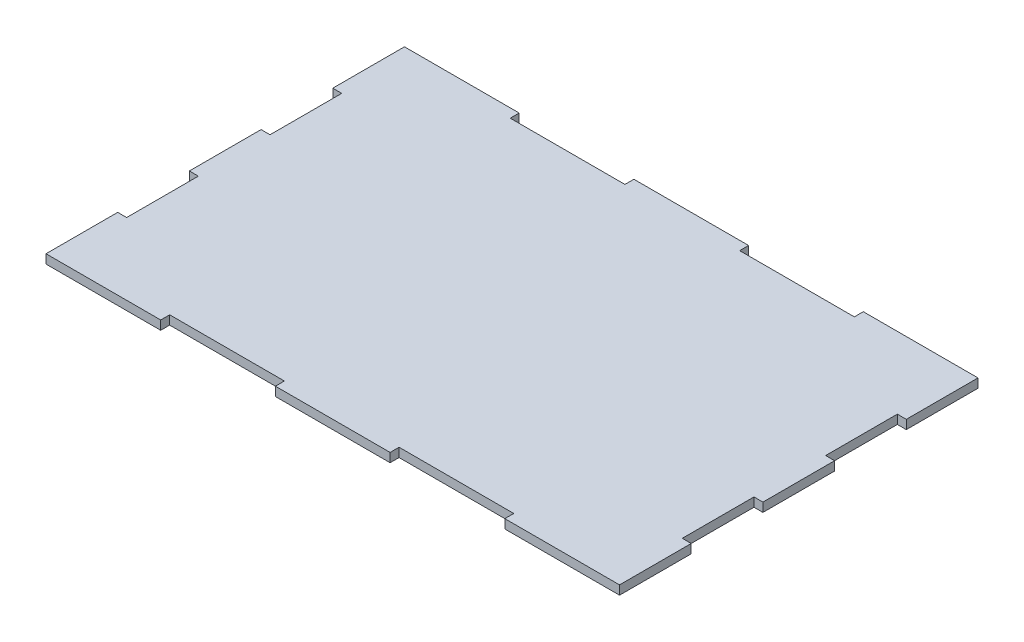
ISO-10303-21;
HEADER;
FILE_DESCRIPTION(('STEP AP214'),'2;1');
FILE_NAME('part.step','',(''),(''),'','','');
FILE_SCHEMA(('AUTOMOTIVE_DESIGN { 1 0 10303 214 1 1 1 1 }'));
ENDSEC;
DATA;
#1=APPLICATION_CONTEXT('core data for automotive mechanical design processes');
#2=APPLICATION_PROTOCOL_DEFINITION('international standard','automotive_design',2000,#1);
#3=PRODUCT_CONTEXT('',#1,'mechanical');
#4=PRODUCT('Part','Part','',(#3));
#5=PRODUCT_RELATED_PRODUCT_CATEGORY('part','',(#4));
#6=PRODUCT_DEFINITION_FORMATION('','',#4);
#7=PRODUCT_DEFINITION_CONTEXT('part definition',#1,'design');
#8=PRODUCT_DEFINITION('design','',#6,#7);
#9=PRODUCT_DEFINITION_SHAPE('','',#8);
#10=(LENGTH_UNIT() NAMED_UNIT(*) SI_UNIT(.MILLI.,.METRE.));
#11=(NAMED_UNIT(*) PLANE_ANGLE_UNIT() SI_UNIT($,.RADIAN.));
#12=(NAMED_UNIT(*) SI_UNIT($,.STERADIAN.) SOLID_ANGLE_UNIT());
#13=UNCERTAINTY_MEASURE_WITH_UNIT(LENGTH_MEASURE(1.E-05),#10,'distance_accuracy_value','');
#14=(GEOMETRIC_REPRESENTATION_CONTEXT(3) GLOBAL_UNCERTAINTY_ASSIGNED_CONTEXT((#13)) GLOBAL_UNIT_ASSIGNED_CONTEXT((#10,
#11,#12)) REPRESENTATION_CONTEXT('',''));
#15=CARTESIAN_POINT('',(0.,0.,0.));
#16=DIRECTION('',(0.,0.,1.));
#17=DIRECTION('',(1.,0.,0.));
#18=AXIS2_PLACEMENT_3D('',#15,#16,#17);
#19=CARTESIAN_POINT('',(101.6,3.175,63.5));
#20=DIRECTION('',(-1.,0.,0.));
#21=DIRECTION('',(0.,0.,1.));
#22=AXIS2_PLACEMENT_3D('',#19,#20,#21);
#23=PLANE('',#22);
#24=DIRECTION('',(0.,0.,-1.));
#25=VECTOR('',#24,1.);
#26=CARTESIAN_POINT('',(101.6,0.,63.5));
#27=LINE('',#26,#25);
#28=CARTESIAN_POINT('',(101.6,0.,12.7));
#29=VERTEX_POINT('',#28);
#30=CARTESIAN_POINT('',(101.6,0.,-12.7));
#31=VERTEX_POINT('',#30);
#32=EDGE_CURVE('E289',#29,#31,#27,.T.);
#33=ORIENTED_EDGE('',*,*,#32,.T.);
#34=DIRECTION('',(0.,1.,0.));
#35=VECTOR('',#34,1.);
#36=CARTESIAN_POINT('',(101.6,0.,-12.7));
#37=LINE('',#36,#35);
#38=CARTESIAN_POINT('',(101.6,3.175,-12.7));
#39=VERTEX_POINT('',#38);
#40=EDGE_CURVE('E940',#31,#39,#37,.T.);
#41=ORIENTED_EDGE('',*,*,#40,.T.);
#42=DIRECTION('',(0.,0.,-1.));
#43=VECTOR('',#42,1.);
#44=CARTESIAN_POINT('',(101.6,3.175,63.5));
#45=LINE('',#44,#43);
#46=CARTESIAN_POINT('',(101.6,3.175,12.7));
#47=VERTEX_POINT('',#46);
#48=EDGE_CURVE('E339',#47,#39,#45,.T.);
#49=ORIENTED_EDGE('',*,*,#48,.F.);
#50=DIRECTION('',(0.,1.,0.));
#51=VECTOR('',#50,1.);
#52=CARTESIAN_POINT('',(101.6,0.,12.7));
#53=LINE('',#52,#51);
#54=EDGE_CURVE('E573',#29,#47,#53,.T.);
#55=ORIENTED_EDGE('',*,*,#54,.F.);
#56=EDGE_LOOP('',(#33,#41,#49,#55));
#57=FACE_BOUND('',#56,.T.);
#58=ADVANCED_FACE('F33',(#57),#23,.F.);
#59=CARTESIAN_POINT('',(101.6,0.,63.5));
#60=VERTEX_POINT('',#59);
#61=CARTESIAN_POINT('',(101.6,0.,38.1));
#62=VERTEX_POINT('',#61);
#63=EDGE_CURVE('E292',#60,#62,#27,.T.);
#64=ORIENTED_EDGE('',*,*,#63,.T.);
#65=DIRECTION('',(0.,1.,0.));
#66=VECTOR('',#65,1.);
#67=CARTESIAN_POINT('',(101.6,0.,38.1));
#68=LINE('',#67,#66);
#69=CARTESIAN_POINT('',(101.6,3.175,38.1));
#70=VERTEX_POINT('',#69);
#71=EDGE_CURVE('E399',#62,#70,#68,.T.);
#72=ORIENTED_EDGE('',*,*,#71,.T.);
#73=CARTESIAN_POINT('',(101.6,3.175,63.5));
#74=VERTEX_POINT('',#73);
#75=EDGE_CURVE('E341',#74,#70,#45,.T.);
#76=ORIENTED_EDGE('',*,*,#75,.F.);
#77=DIRECTION('',(0.,-1.,0.));
#78=VECTOR('',#77,1.);
#79=CARTESIAN_POINT('',(101.6,3.175,63.5));
#80=LINE('',#79,#78);
#81=EDGE_CURVE('E373',#74,#60,#80,.T.);
#82=ORIENTED_EDGE('',*,*,#81,.T.);
#83=EDGE_LOOP('',(#64,#72,#76,#82));
#84=FACE_BOUND('',#83,.T.);
#85=ADVANCED_FACE('F560',(#84),#23,.F.);
#86=CARTESIAN_POINT('',(-101.6,3.175,63.5));
#87=DIRECTION('',(1.,0.,0.));
#88=DIRECTION('',(0.,0.,-1.));
#89=AXIS2_PLACEMENT_3D('',#86,#87,#88);
#90=PLANE('',#89);
#91=DIRECTION('',(0.,0.,1.));
#92=VECTOR('',#91,1.);
#93=CARTESIAN_POINT('',(-101.6,0.,63.5));
#94=LINE('',#93,#92);
#95=CARTESIAN_POINT('',(-101.6,0.,-63.5));
#96=VERTEX_POINT('',#95);
#97=CARTESIAN_POINT('',(-101.6,0.,-38.1));
#98=VERTEX_POINT('',#97);
#99=EDGE_CURVE('E315',#96,#98,#94,.T.);
#100=ORIENTED_EDGE('',*,*,#99,.T.);
#101=DIRECTION('',(0.,1.,0.));
#102=VECTOR('',#101,1.);
#103=CARTESIAN_POINT('',(-101.6,0.,-38.1));
#104=LINE('',#103,#102);
#105=CARTESIAN_POINT('',(-101.6,3.175,-38.1));
#106=VERTEX_POINT('',#105);
#107=EDGE_CURVE('E404',#98,#106,#104,.T.);
#108=ORIENTED_EDGE('',*,*,#107,.T.);
#109=DIRECTION('',(0.,0.,1.));
#110=VECTOR('',#109,1.);
#111=CARTESIAN_POINT('',(-101.6,3.175,63.5));
#112=LINE('',#111,#110);
#113=CARTESIAN_POINT('',(-101.6,3.175,-63.5));
#114=VERTEX_POINT('',#113);
#115=EDGE_CURVE('E361',#114,#106,#112,.T.);
#116=ORIENTED_EDGE('',*,*,#115,.F.);
#117=DIRECTION('',(0.,-1.,0.));
#118=VECTOR('',#117,1.);
#119=CARTESIAN_POINT('',(-101.6,3.175,-63.5));
#120=LINE('',#119,#118);
#121=EDGE_CURVE('E41',#114,#96,#120,.T.);
#122=ORIENTED_EDGE('',*,*,#121,.T.);
#123=EDGE_LOOP('',(#100,#108,#116,#122));
#124=FACE_BOUND('',#123,.T.);
#125=ADVANCED_FACE('F378',(#124),#90,.F.);
#126=CARTESIAN_POINT('',(-101.6,3.175,-12.7));
#127=VERTEX_POINT('',#126);
#128=CARTESIAN_POINT('',(-101.6,3.175,12.7));
#129=VERTEX_POINT('',#128);
#130=EDGE_CURVE('E360',#127,#129,#112,.T.);
#131=ORIENTED_EDGE('',*,*,#130,.F.);
#132=DIRECTION('',(0.,1.,0.));
#133=VECTOR('',#132,1.);
#134=CARTESIAN_POINT('',(-101.6,0.,-12.7));
#135=LINE('',#134,#133);
#136=CARTESIAN_POINT('',(-101.6,0.,-12.7));
#137=VERTEX_POINT('',#136);
#138=EDGE_CURVE('E387',#137,#127,#135,.T.);
#139=ORIENTED_EDGE('',*,*,#138,.F.);
#140=CARTESIAN_POINT('',(-101.6,0.,12.7));
#141=VERTEX_POINT('',#140);
#142=EDGE_CURVE('E314',#137,#141,#94,.T.);
#143=ORIENTED_EDGE('',*,*,#142,.T.);
#144=DIRECTION('',(0.,1.,0.));
#145=VECTOR('',#144,1.);
#146=CARTESIAN_POINT('',(-101.6,0.,12.7));
#147=LINE('',#146,#145);
#148=EDGE_CURVE('E428',#141,#129,#147,.T.);
#149=ORIENTED_EDGE('',*,*,#148,.T.);
#150=EDGE_LOOP('',(#131,#139,#143,#149));
#151=FACE_BOUND('',#150,.T.);
#152=ADVANCED_FACE('F583',(#151),#90,.F.);
#153=CARTESIAN_POINT('',(-101.6,3.175,-63.5));
#154=DIRECTION('',(0.,0.,1.));
#155=DIRECTION('',(1.,0.,0.));
#156=AXIS2_PLACEMENT_3D('',#153,#154,#155);
#157=PLANE('',#156);
#158=DIRECTION('',(-1.,0.,0.));
#159=VECTOR('',#158,1.);
#160=CARTESIAN_POINT('',(-101.6,0.,-63.5));
#161=LINE('',#160,#159);
#162=CARTESIAN_POINT('',(101.6,0.,-63.5));
#163=VERTEX_POINT('',#162);
#164=CARTESIAN_POINT('',(60.96,0.,-63.5));
#165=VERTEX_POINT('',#164);
#166=EDGE_CURVE('E288',#163,#165,#161,.T.);
#167=ORIENTED_EDGE('',*,*,#166,.T.);
#168=DIRECTION('',(0.,1.,0.));
#169=VECTOR('',#168,1.);
#170=CARTESIAN_POINT('',(60.96,0.,-63.5));
#171=LINE('',#170,#169);
#172=CARTESIAN_POINT('',(60.96,3.175,-63.5));
#173=VERTEX_POINT('',#172);
#174=EDGE_CURVE('E446',#165,#173,#171,.T.);
#175=ORIENTED_EDGE('',*,*,#174,.T.);
#176=DIRECTION('',(-1.,0.,0.));
#177=VECTOR('',#176,1.);
#178=CARTESIAN_POINT('',(-101.6,3.175,-63.5));
#179=LINE('',#178,#177);
#180=CARTESIAN_POINT('',(101.6,3.175,-63.5));
#181=VERTEX_POINT('',#180);
#182=EDGE_CURVE('E353',#181,#173,#179,.T.);
#183=ORIENTED_EDGE('',*,*,#182,.F.);
#184=DIRECTION('',(0.,-1.,0.));
#185=VECTOR('',#184,1.);
#186=CARTESIAN_POINT('',(101.6,3.175,-63.5));
#187=LINE('',#186,#185);
#188=EDGE_CURVE('E11',#181,#163,#187,.T.);
#189=ORIENTED_EDGE('',*,*,#188,.T.);
#190=EDGE_LOOP('',(#167,#175,#183,#189));
#191=FACE_BOUND('',#190,.T.);
#192=ADVANCED_FACE('F619',(#191),#157,.F.);
#193=CARTESIAN_POINT('',(20.32,3.175,-63.5));
#194=VERTEX_POINT('',#193);
#195=CARTESIAN_POINT('',(-20.32,3.175,-63.5));
#196=VERTEX_POINT('',#195);
#197=EDGE_CURVE('E352',#194,#196,#179,.T.);
#198=ORIENTED_EDGE('',*,*,#197,.F.);
#199=DIRECTION('',(0.,1.,0.));
#200=VECTOR('',#199,1.);
#201=CARTESIAN_POINT('',(20.32,0.,-63.5));
#202=LINE('',#201,#200);
#203=CARTESIAN_POINT('',(20.32,0.,-63.5));
#204=VERTEX_POINT('',#203);
#205=EDGE_CURVE('E458',#204,#194,#202,.T.);
#206=ORIENTED_EDGE('',*,*,#205,.F.);
#207=CARTESIAN_POINT('',(-20.32,0.,-63.5));
#208=VERTEX_POINT('',#207);
#209=EDGE_CURVE('E304',#204,#208,#161,.T.);
#210=ORIENTED_EDGE('',*,*,#209,.T.);
#211=DIRECTION('',(0.,1.,0.));
#212=VECTOR('',#211,1.);
#213=CARTESIAN_POINT('',(-20.32,0.,-63.5));
#214=LINE('',#213,#212);
#215=EDGE_CURVE('E470',#208,#196,#214,.T.);
#216=ORIENTED_EDGE('',*,*,#215,.T.);
#217=EDGE_LOOP('',(#198,#206,#210,#216));
#218=FACE_BOUND('',#217,.T.);
#219=ADVANCED_FACE('F620',(#218),#157,.F.);
#220=CARTESIAN_POINT('',(-101.6,3.175,63.5));
#221=DIRECTION('',(0.,0.,-1.));
#222=DIRECTION('',(-1.,0.,0.));
#223=AXIS2_PLACEMENT_3D('',#220,#221,#222);
#224=PLANE('',#223);
#225=DIRECTION('',(1.,0.,0.));
#226=VECTOR('',#225,1.);
#227=CARTESIAN_POINT('',(-101.6,3.175,63.5));
#228=LINE('',#227,#226);
#229=CARTESIAN_POINT('',(60.96,3.175,63.5));
#230=VERTEX_POINT('',#229);
#231=EDGE_CURVE('E365',#230,#74,#228,.T.);
#232=ORIENTED_EDGE('',*,*,#231,.F.);
#233=DIRECTION('',(0.,1.,0.));
#234=VECTOR('',#233,1.);
#235=CARTESIAN_POINT('',(60.96,0.,63.5));
#236=LINE('',#235,#234);
#237=CARTESIAN_POINT('',(60.96,0.,63.5));
#238=VERTEX_POINT('',#237);
#239=EDGE_CURVE('E504',#238,#230,#236,.T.);
#240=ORIENTED_EDGE('',*,*,#239,.F.);
#241=DIRECTION('',(1.,0.,0.));
#242=VECTOR('',#241,1.);
#243=CARTESIAN_POINT('',(-101.6,0.,63.5));
#244=LINE('',#243,#242);
#245=EDGE_CURVE('E323',#238,#60,#244,.T.);
#246=ORIENTED_EDGE('',*,*,#245,.T.);
#247=ORIENTED_EDGE('',*,*,#81,.F.);
#248=EDGE_LOOP('',(#232,#240,#246,#247));
#249=FACE_BOUND('',#248,.T.);
#250=ADVANCED_FACE('F559',(#249),#224,.F.);
#251=CARTESIAN_POINT('',(-20.32,0.,63.5));
#252=VERTEX_POINT('',#251);
#253=CARTESIAN_POINT('',(20.32,0.,63.5));
#254=VERTEX_POINT('',#253);
#255=EDGE_CURVE('E327',#252,#254,#244,.T.);
#256=ORIENTED_EDGE('',*,*,#255,.T.);
#257=DIRECTION('',(0.,1.,0.));
#258=VECTOR('',#257,1.);
#259=CARTESIAN_POINT('',(20.32,0.,63.5));
#260=LINE('',#259,#258);
#261=CARTESIAN_POINT('',(20.32,3.175,63.5));
#262=VERTEX_POINT('',#261);
#263=EDGE_CURVE('E507',#254,#262,#260,.T.);
#264=ORIENTED_EDGE('',*,*,#263,.T.);
#265=CARTESIAN_POINT('',(-20.32,3.175,63.5));
#266=VERTEX_POINT('',#265);
#267=EDGE_CURVE('E368',#266,#262,#228,.T.);
#268=ORIENTED_EDGE('',*,*,#267,.F.);
#269=DIRECTION('',(0.,1.,0.));
#270=VECTOR('',#269,1.);
#271=CARTESIAN_POINT('',(-20.32,0.,63.5));
#272=LINE('',#271,#270);
#273=EDGE_CURVE('E290',#252,#266,#272,.T.);
#274=ORIENTED_EDGE('',*,*,#273,.F.);
#275=EDGE_LOOP('',(#256,#264,#268,#274));
#276=FACE_BOUND('',#275,.T.);
#277=ADVANCED_FACE('F548',(#276),#224,.F.);
#278=CARTESIAN_POINT('',(101.6,3.175,-38.1));
#279=VERTEX_POINT('',#278);
#280=EDGE_CURVE('E281',#279,#181,#45,.T.);
#281=ORIENTED_EDGE('',*,*,#280,.F.);
#282=DIRECTION('',(0.,1.,0.));
#283=VECTOR('',#282,1.);
#284=CARTESIAN_POINT('',(101.6,0.,-38.1));
#285=LINE('',#284,#283);
#286=CARTESIAN_POINT('',(101.6,0.,-38.1));
#287=VERTEX_POINT('',#286);
#288=EDGE_CURVE('E269',#287,#279,#285,.T.);
#289=ORIENTED_EDGE('',*,*,#288,.F.);
#290=EDGE_CURVE('E279',#287,#163,#27,.T.);
#291=ORIENTED_EDGE('',*,*,#290,.T.);
#292=ORIENTED_EDGE('',*,*,#188,.F.);
#293=EDGE_LOOP('',(#281,#289,#291,#292));
#294=FACE_BOUND('',#293,.T.);
#295=ADVANCED_FACE('F35',(#294),#23,.F.);
#296=CARTESIAN_POINT('',(-60.96,3.175,-63.5));
#297=VERTEX_POINT('',#296);
#298=EDGE_CURVE('E349',#297,#114,#179,.T.);
#299=ORIENTED_EDGE('',*,*,#298,.F.);
#300=DIRECTION('',(0.,1.,0.));
#301=VECTOR('',#300,1.);
#302=CARTESIAN_POINT('',(-60.96,0.,-63.5));
#303=LINE('',#302,#301);
#304=CARTESIAN_POINT('',(-60.96,0.,-63.5));
#305=VERTEX_POINT('',#304);
#306=EDGE_CURVE('E483',#305,#297,#303,.T.);
#307=ORIENTED_EDGE('',*,*,#306,.F.);
#308=EDGE_CURVE('E299',#305,#96,#161,.T.);
#309=ORIENTED_EDGE('',*,*,#308,.T.);
#310=ORIENTED_EDGE('',*,*,#121,.F.);
#311=EDGE_LOOP('',(#299,#307,#309,#310));
#312=FACE_BOUND('',#311,.T.);
#313=ADVANCED_FACE('F614',(#312),#157,.F.);
#314=CARTESIAN_POINT('',(-101.6,3.175,38.1));
#315=VERTEX_POINT('',#314);
#316=CARTESIAN_POINT('',(-101.6,3.175,63.5));
#317=VERTEX_POINT('',#316);
#318=EDGE_CURVE('E358',#315,#317,#112,.T.);
#319=ORIENTED_EDGE('',*,*,#318,.F.);
#320=DIRECTION('',(0.,1.,0.));
#321=VECTOR('',#320,1.);
#322=CARTESIAN_POINT('',(-101.6,0.,38.1));
#323=LINE('',#322,#321);
#324=CARTESIAN_POINT('',(-101.6,0.,38.1));
#325=VERTEX_POINT('',#324);
#326=EDGE_CURVE('E420',#325,#315,#323,.T.);
#327=ORIENTED_EDGE('',*,*,#326,.F.);
#328=CARTESIAN_POINT('',(-101.6,0.,63.5));
#329=VERTEX_POINT('',#328);
#330=EDGE_CURVE('E311',#325,#329,#94,.T.);
#331=ORIENTED_EDGE('',*,*,#330,.T.);
#332=DIRECTION('',(0.,-1.,0.));
#333=VECTOR('',#332,1.);
#334=CARTESIAN_POINT('',(-101.6,3.175,63.5));
#335=LINE('',#334,#333);
#336=EDGE_CURVE('E376',#317,#329,#335,.T.);
#337=ORIENTED_EDGE('',*,*,#336,.F.);
#338=EDGE_LOOP('',(#319,#327,#331,#337));
#339=FACE_BOUND('',#338,.T.);
#340=ADVANCED_FACE('F595',(#339),#90,.F.);
#341=CARTESIAN_POINT('',(-60.96,0.,63.5));
#342=VERTEX_POINT('',#341);
#343=EDGE_CURVE('E328',#329,#342,#244,.T.);
#344=ORIENTED_EDGE('',*,*,#343,.T.);
#345=DIRECTION('',(0.,1.,0.));
#346=VECTOR('',#345,1.);
#347=CARTESIAN_POINT('',(-60.96,0.,63.5));
#348=LINE('',#347,#346);
#349=CARTESIAN_POINT('',(-60.96,3.175,63.5));
#350=VERTEX_POINT('',#349);
#351=EDGE_CURVE('E294',#342,#350,#348,.T.);
#352=ORIENTED_EDGE('',*,*,#351,.T.);
#353=EDGE_CURVE('E369',#317,#350,#228,.T.);
#354=ORIENTED_EDGE('',*,*,#353,.F.);
#355=ORIENTED_EDGE('',*,*,#336,.T.);
#356=EDGE_LOOP('',(#344,#352,#354,#355));
#357=FACE_BOUND('',#356,.T.);
#358=ADVANCED_FACE('F545',(#357),#224,.F.);
#359=CARTESIAN_POINT('',(0.,3.175,0.));
#360=DIRECTION('',(0.,-1.,0.));
#361=DIRECTION('',(0.,0.,-1.));
#362=AXIS2_PLACEMENT_3D('',#359,#360,#361);
#363=PLANE('',#362);
#364=ORIENTED_EDGE('',*,*,#48,.T.);
#365=DIRECTION('',(1.,0.,0.));
#366=VECTOR('',#365,1.);
#367=CARTESIAN_POINT('',(101.6,3.175,-12.7));
#368=LINE('',#367,#366);
#369=CARTESIAN_POINT('',(98.425,3.175,-12.7));
#370=VERTEX_POINT('',#369);
#371=EDGE_CURVE('E274',#370,#39,#368,.T.);
#372=ORIENTED_EDGE('',*,*,#371,.F.);
#373=DIRECTION('',(0.,0.,1.));
#374=VECTOR('',#373,1.);
#375=CARTESIAN_POINT('',(98.425,3.175,-12.7));
#376=LINE('',#375,#374);
#377=CARTESIAN_POINT('',(98.425,3.175,-38.1));
#378=VERTEX_POINT('',#377);
#379=EDGE_CURVE('E928',#378,#370,#376,.T.);
#380=ORIENTED_EDGE('',*,*,#379,.F.);
#381=DIRECTION('',(-1.,0.,0.));
#382=VECTOR('',#381,1.);
#383=CARTESIAN_POINT('',(101.6,3.175,-38.1));
#384=LINE('',#383,#382);
#385=EDGE_CURVE('E932',#279,#378,#384,.T.);
#386=ORIENTED_EDGE('',*,*,#385,.F.);
#387=ORIENTED_EDGE('',*,*,#280,.T.);
#388=ORIENTED_EDGE('',*,*,#182,.T.);
#389=DIRECTION('',(0.,0.,-1.));
#390=VECTOR('',#389,1.);
#391=CARTESIAN_POINT('',(60.96,3.175,-60.325));
#392=LINE('',#391,#390);
#393=CARTESIAN_POINT('',(60.96,3.175,-60.325));
#394=VERTEX_POINT('',#393);
#395=EDGE_CURVE('E431',#394,#173,#392,.T.);
#396=ORIENTED_EDGE('',*,*,#395,.F.);
#397=DIRECTION('',(1.,0.,0.));
#398=VECTOR('',#397,1.);
#399=CARTESIAN_POINT('',(60.96,3.175,-60.325));
#400=LINE('',#399,#398);
#401=CARTESIAN_POINT('',(20.32,3.175,-60.325));
#402=VERTEX_POINT('',#401);
#403=EDGE_CURVE('E440',#402,#394,#400,.T.);
#404=ORIENTED_EDGE('',*,*,#403,.F.);
#405=DIRECTION('',(0.,0.,1.));
#406=VECTOR('',#405,1.);
#407=CARTESIAN_POINT('',(20.32,3.175,-60.325));
#408=LINE('',#407,#406);
#409=EDGE_CURVE('E448',#194,#402,#408,.T.);
#410=ORIENTED_EDGE('',*,*,#409,.F.);
#411=ORIENTED_EDGE('',*,*,#197,.T.);
#412=DIRECTION('',(0.,0.,-1.));
#413=VECTOR('',#412,1.);
#414=CARTESIAN_POINT('',(-20.32,3.175,-60.325));
#415=LINE('',#414,#413);
#416=CARTESIAN_POINT('',(-20.32,3.175,-60.325));
#417=VERTEX_POINT('',#416);
#418=EDGE_CURVE('E455',#417,#196,#415,.T.);
#419=ORIENTED_EDGE('',*,*,#418,.F.);
#420=DIRECTION('',(1.,0.,0.));
#421=VECTOR('',#420,1.);
#422=CARTESIAN_POINT('',(-20.32,3.175,-60.325));
#423=LINE('',#422,#421);
#424=CARTESIAN_POINT('',(-60.96,3.175,-60.325));
#425=VERTEX_POINT('',#424);
#426=EDGE_CURVE('E465',#425,#417,#423,.T.);
#427=ORIENTED_EDGE('',*,*,#426,.F.);
#428=DIRECTION('',(0.,0.,1.));
#429=VECTOR('',#428,1.);
#430=CARTESIAN_POINT('',(-60.96,3.175,-60.325));
#431=LINE('',#430,#429);
#432=EDGE_CURVE('E473',#297,#425,#431,.T.);
#433=ORIENTED_EDGE('',*,*,#432,.F.);
#434=ORIENTED_EDGE('',*,*,#298,.T.);
#435=ORIENTED_EDGE('',*,*,#115,.T.);
#436=DIRECTION('',(-1.,0.,0.));
#437=VECTOR('',#436,1.);
#438=CARTESIAN_POINT('',(-101.6,3.175,-38.1));
#439=LINE('',#438,#437);
#440=CARTESIAN_POINT('',(-98.425,3.175,-38.1));
#441=VERTEX_POINT('',#440);
#442=EDGE_CURVE('E402',#441,#106,#439,.T.);
#443=ORIENTED_EDGE('',*,*,#442,.F.);
#444=DIRECTION('',(0.,0.,-1.));
#445=VECTOR('',#444,1.);
#446=CARTESIAN_POINT('',(-98.425,3.175,-12.7));
#447=LINE('',#446,#445);
#448=CARTESIAN_POINT('',(-98.425,3.175,-12.7));
#449=VERTEX_POINT('',#448);
#450=EDGE_CURVE('E398',#449,#441,#447,.T.);
#451=ORIENTED_EDGE('',*,*,#450,.F.);
#452=DIRECTION('',(1.,0.,0.));
#453=VECTOR('',#452,1.);
#454=CARTESIAN_POINT('',(-101.6,3.175,-12.7));
#455=LINE('',#454,#453);
#456=EDGE_CURVE('E395',#127,#449,#455,.T.);
#457=ORIENTED_EDGE('',*,*,#456,.F.);
#458=ORIENTED_EDGE('',*,*,#130,.T.);
#459=DIRECTION('',(-1.,0.,0.));
#460=VECTOR('',#459,1.);
#461=CARTESIAN_POINT('',(-101.6,3.175,12.7));
#462=LINE('',#461,#460);
#463=CARTESIAN_POINT('',(-98.425,3.175,12.7));
#464=VERTEX_POINT('',#463);
#465=EDGE_CURVE('E414',#464,#129,#462,.T.);
#466=ORIENTED_EDGE('',*,*,#465,.F.);
#467=DIRECTION('',(0.,0.,-1.));
#468=VECTOR('',#467,1.);
#469=CARTESIAN_POINT('',(-98.425,3.175,38.1));
#470=LINE('',#469,#468);
#471=CARTESIAN_POINT('',(-98.425,3.175,38.1));
#472=VERTEX_POINT('',#471);
#473=EDGE_CURVE('E423',#472,#464,#470,.T.);
#474=ORIENTED_EDGE('',*,*,#473,.F.);
#475=DIRECTION('',(1.,0.,0.));
#476=VECTOR('',#475,1.);
#477=CARTESIAN_POINT('',(-101.6,3.175,38.1));
#478=LINE('',#477,#476);
#479=EDGE_CURVE('E406',#315,#472,#478,.T.);
#480=ORIENTED_EDGE('',*,*,#479,.F.);
#481=ORIENTED_EDGE('',*,*,#318,.T.);
#482=ORIENTED_EDGE('',*,*,#353,.T.);
#483=DIRECTION('',(0.,0.,1.));
#484=VECTOR('',#483,1.);
#485=CARTESIAN_POINT('',(-60.96,3.175,60.325));
#486=LINE('',#485,#484);
#487=CARTESIAN_POINT('',(-60.96,3.175,60.325));
#488=VERTEX_POINT('',#487);
#489=EDGE_CURVE('E517',#488,#350,#486,.T.);
#490=ORIENTED_EDGE('',*,*,#489,.F.);
#491=DIRECTION('',(-1.,0.,0.));
#492=VECTOR('',#491,1.);
#493=CARTESIAN_POINT('',(-20.32,3.175,60.325));
#494=LINE('',#493,#492);
#495=CARTESIAN_POINT('',(-20.32,3.175,60.325));
#496=VERTEX_POINT('',#495);
#497=EDGE_CURVE('E526',#496,#488,#494,.T.);
#498=ORIENTED_EDGE('',*,*,#497,.F.);
#499=DIRECTION('',(0.,0.,-1.));
#500=VECTOR('',#499,1.);
#501=CARTESIAN_POINT('',(-20.32,3.175,60.325));
#502=LINE('',#501,#500);
#503=EDGE_CURVE('E506',#266,#496,#502,.T.);
#504=ORIENTED_EDGE('',*,*,#503,.F.);
#505=ORIENTED_EDGE('',*,*,#267,.T.);
#506=DIRECTION('',(0.,0.,1.));
#507=VECTOR('',#506,1.);
#508=CARTESIAN_POINT('',(20.32,3.175,60.325));
#509=LINE('',#508,#507);
#510=CARTESIAN_POINT('',(20.32,3.175,60.325));
#511=VERTEX_POINT('',#510);
#512=EDGE_CURVE('E491',#511,#262,#509,.T.);
#513=ORIENTED_EDGE('',*,*,#512,.F.);
#514=DIRECTION('',(-1.,0.,0.));
#515=VECTOR('',#514,1.);
#516=CARTESIAN_POINT('',(60.96,3.175,60.325));
#517=LINE('',#516,#515);
#518=CARTESIAN_POINT('',(60.96,3.175,60.325));
#519=VERTEX_POINT('',#518);
#520=EDGE_CURVE('E500',#519,#511,#517,.T.);
#521=ORIENTED_EDGE('',*,*,#520,.F.);
#522=DIRECTION('',(0.,0.,-1.));
#523=VECTOR('',#522,1.);
#524=CARTESIAN_POINT('',(60.96,3.175,60.325));
#525=LINE('',#524,#523);
#526=EDGE_CURVE('E480',#230,#519,#525,.T.);
#527=ORIENTED_EDGE('',*,*,#526,.F.);
#528=ORIENTED_EDGE('',*,*,#231,.T.);
#529=ORIENTED_EDGE('',*,*,#75,.T.);
#530=DIRECTION('',(1.,0.,0.));
#531=VECTOR('',#530,1.);
#532=CARTESIAN_POINT('',(101.6,3.175,38.1));
#533=LINE('',#532,#531);
#534=CARTESIAN_POINT('',(98.425,3.175,38.1));
#535=VERTEX_POINT('',#534);
#536=EDGE_CURVE('E569',#535,#70,#533,.T.);
#537=ORIENTED_EDGE('',*,*,#536,.F.);
#538=DIRECTION('',(0.,0.,1.));
#539=VECTOR('',#538,1.);
#540=CARTESIAN_POINT('',(98.425,3.175,38.1));
#541=LINE('',#540,#539);
#542=CARTESIAN_POINT('',(98.425,3.175,12.7));
#543=VERTEX_POINT('',#542);
#544=EDGE_CURVE('E951',#543,#535,#541,.T.);
#545=ORIENTED_EDGE('',*,*,#544,.F.);
#546=DIRECTION('',(-1.,0.,0.));
#547=VECTOR('',#546,1.);
#548=CARTESIAN_POINT('',(101.6,3.175,12.7));
#549=LINE('',#548,#547);
#550=EDGE_CURVE('E942',#47,#543,#549,.T.);
#551=ORIENTED_EDGE('',*,*,#550,.F.);
#552=EDGE_LOOP('',(#364,#372,#380,#386,#387,#388,#396,#404,#410,#411,#419,#427,#433,#434,#435,
#443,#451,#457,#458,#466,#474,#480,#481,#482,#490,#498,#504,#505,#513,#521,#527,#528,#529,#537,
#545,#551));
#553=FACE_BOUND('',#552,.T.);
#554=ADVANCED_FACE('F542',(#553),#363,.F.);
#555=CARTESIAN_POINT('',(0.,0.,0.));
#556=DIRECTION('',(0.,-1.,0.));
#557=DIRECTION('',(0.,0.,-1.));
#558=AXIS2_PLACEMENT_3D('',#555,#556,#557);
#559=PLANE('',#558);
#560=DIRECTION('',(1.,0.,0.));
#561=VECTOR('',#560,1.);
#562=CARTESIAN_POINT('',(101.6,0.,-12.7));
#563=LINE('',#562,#561);
#564=CARTESIAN_POINT('',(98.425,0.,-12.7));
#565=VERTEX_POINT('',#564);
#566=EDGE_CURVE('E282',#565,#31,#563,.T.);
#567=ORIENTED_EDGE('',*,*,#566,.T.);
#568=ORIENTED_EDGE('',*,*,#32,.F.);
#569=DIRECTION('',(-1.,0.,0.));
#570=VECTOR('',#569,1.);
#571=CARTESIAN_POINT('',(101.6,0.,12.7));
#572=LINE('',#571,#570);
#573=CARTESIAN_POINT('',(98.425,0.,12.7));
#574=VERTEX_POINT('',#573);
#575=EDGE_CURVE('E945',#29,#574,#572,.T.);
#576=ORIENTED_EDGE('',*,*,#575,.T.);
#577=DIRECTION('',(0.,0.,1.));
#578=VECTOR('',#577,1.);
#579=CARTESIAN_POINT('',(98.425,0.,38.1));
#580=LINE('',#579,#578);
#581=CARTESIAN_POINT('',(98.425,0.,38.1));
#582=VERTEX_POINT('',#581);
#583=EDGE_CURVE('E56',#574,#582,#580,.T.);
#584=ORIENTED_EDGE('',*,*,#583,.T.);
#585=DIRECTION('',(1.,0.,0.));
#586=VECTOR('',#585,1.);
#587=CARTESIAN_POINT('',(101.6,0.,38.1));
#588=LINE('',#587,#586);
#589=EDGE_CURVE('E574',#582,#62,#588,.T.);
#590=ORIENTED_EDGE('',*,*,#589,.T.);
#591=ORIENTED_EDGE('',*,*,#63,.F.);
#592=ORIENTED_EDGE('',*,*,#245,.F.);
#593=DIRECTION('',(0.,0.,-1.));
#594=VECTOR('',#593,1.);
#595=CARTESIAN_POINT('',(60.96,0.,60.325));
#596=LINE('',#595,#594);
#597=CARTESIAN_POINT('',(60.96,0.,60.325));
#598=VERTEX_POINT('',#597);
#599=EDGE_CURVE('E487',#238,#598,#596,.T.);
#600=ORIENTED_EDGE('',*,*,#599,.T.);
#601=DIRECTION('',(-1.,0.,0.));
#602=VECTOR('',#601,1.);
#603=CARTESIAN_POINT('',(60.96,0.,60.325));
#604=LINE('',#603,#602);
#605=CARTESIAN_POINT('',(20.32,0.,60.325));
#606=VERTEX_POINT('',#605);
#607=EDGE_CURVE('E490',#598,#606,#604,.T.);
#608=ORIENTED_EDGE('',*,*,#607,.T.);
#609=DIRECTION('',(0.,0.,1.));
#610=VECTOR('',#609,1.);
#611=CARTESIAN_POINT('',(20.32,0.,60.325));
#612=LINE('',#611,#610);
#613=EDGE_CURVE('E494',#606,#254,#612,.T.);
#614=ORIENTED_EDGE('',*,*,#613,.T.);
#615=ORIENTED_EDGE('',*,*,#255,.F.);
#616=DIRECTION('',(0.,0.,-1.));
#617=VECTOR('',#616,1.);
#618=CARTESIAN_POINT('',(-20.32,0.,60.325));
#619=LINE('',#618,#617);
#620=CARTESIAN_POINT('',(-20.32,0.,60.325));
#621=VERTEX_POINT('',#620);
#622=EDGE_CURVE('E513',#252,#621,#619,.T.);
#623=ORIENTED_EDGE('',*,*,#622,.T.);
#624=DIRECTION('',(-1.,0.,0.));
#625=VECTOR('',#624,1.);
#626=CARTESIAN_POINT('',(-20.32,0.,60.325));
#627=LINE('',#626,#625);
#628=CARTESIAN_POINT('',(-60.96,0.,60.325));
#629=VERTEX_POINT('',#628);
#630=EDGE_CURVE('E516',#621,#629,#627,.T.);
#631=ORIENTED_EDGE('',*,*,#630,.T.);
#632=DIRECTION('',(0.,0.,1.));
#633=VECTOR('',#632,1.);
#634=CARTESIAN_POINT('',(-60.96,0.,60.325));
#635=LINE('',#634,#633);
#636=EDGE_CURVE('E520',#629,#342,#635,.T.);
#637=ORIENTED_EDGE('',*,*,#636,.T.);
#638=ORIENTED_EDGE('',*,*,#343,.F.);
#639=ORIENTED_EDGE('',*,*,#330,.F.);
#640=DIRECTION('',(1.,0.,0.));
#641=VECTOR('',#640,1.);
#642=CARTESIAN_POINT('',(-101.6,0.,38.1));
#643=LINE('',#642,#641);
#644=CARTESIAN_POINT('',(-98.425,0.,38.1));
#645=VERTEX_POINT('',#644);
#646=EDGE_CURVE('E410',#325,#645,#643,.T.);
#647=ORIENTED_EDGE('',*,*,#646,.T.);
#648=DIRECTION('',(0.,0.,-1.));
#649=VECTOR('',#648,1.);
#650=CARTESIAN_POINT('',(-98.425,0.,38.1));
#651=LINE('',#650,#649);
#652=CARTESIAN_POINT('',(-98.425,0.,12.7));
#653=VERTEX_POINT('',#652);
#654=EDGE_CURVE('E413',#645,#653,#651,.T.);
#655=ORIENTED_EDGE('',*,*,#654,.T.);
#656=DIRECTION('',(-1.,0.,0.));
#657=VECTOR('',#656,1.);
#658=CARTESIAN_POINT('',(-101.6,0.,12.7));
#659=LINE('',#658,#657);
#660=EDGE_CURVE('E417',#653,#141,#659,.T.);
#661=ORIENTED_EDGE('',*,*,#660,.T.);
#662=ORIENTED_EDGE('',*,*,#142,.F.);
#663=DIRECTION('',(1.,0.,0.));
#664=VECTOR('',#663,1.);
#665=CARTESIAN_POINT('',(-101.6,0.,-12.7));
#666=LINE('',#665,#664);
#667=CARTESIAN_POINT('',(-98.425,0.,-12.7));
#668=VERTEX_POINT('',#667);
#669=EDGE_CURVE('E391',#137,#668,#666,.T.);
#670=ORIENTED_EDGE('',*,*,#669,.T.);
#671=DIRECTION('',(0.,0.,-1.));
#672=VECTOR('',#671,1.);
#673=CARTESIAN_POINT('',(-98.425,0.,-12.7));
#674=LINE('',#673,#672);
#675=CARTESIAN_POINT('',(-98.425,0.,-38.1));
#676=VERTEX_POINT('',#675);
#677=EDGE_CURVE('E385',#668,#676,#674,.T.);
#678=ORIENTED_EDGE('',*,*,#677,.T.);
#679=DIRECTION('',(-1.,0.,0.));
#680=VECTOR('',#679,1.);
#681=CARTESIAN_POINT('',(-101.6,0.,-38.1));
#682=LINE('',#681,#680);
#683=EDGE_CURVE('E383',#676,#98,#682,.T.);
#684=ORIENTED_EDGE('',*,*,#683,.T.);
#685=ORIENTED_EDGE('',*,*,#99,.F.);
#686=ORIENTED_EDGE('',*,*,#308,.F.);
#687=DIRECTION('',(0.,0.,1.));
#688=VECTOR('',#687,1.);
#689=CARTESIAN_POINT('',(-60.96,0.,-60.325));
#690=LINE('',#689,#688);
#691=CARTESIAN_POINT('',(-60.96,0.,-60.325));
#692=VERTEX_POINT('',#691);
#693=EDGE_CURVE('E464',#305,#692,#690,.T.);
#694=ORIENTED_EDGE('',*,*,#693,.T.);
#695=DIRECTION('',(1.,0.,0.));
#696=VECTOR('',#695,1.);
#697=CARTESIAN_POINT('',(-20.32,0.,-60.325));
#698=LINE('',#697,#696);
#699=CARTESIAN_POINT('',(-20.32,0.,-60.325));
#700=VERTEX_POINT('',#699);
#701=EDGE_CURVE('E467',#692,#700,#698,.T.);
#702=ORIENTED_EDGE('',*,*,#701,.T.);
#703=DIRECTION('',(0.,0.,-1.));
#704=VECTOR('',#703,1.);
#705=CARTESIAN_POINT('',(-20.32,0.,-60.325));
#706=LINE('',#705,#704);
#707=EDGE_CURVE('E461',#700,#208,#706,.T.);
#708=ORIENTED_EDGE('',*,*,#707,.T.);
#709=ORIENTED_EDGE('',*,*,#209,.F.);
#710=DIRECTION('',(0.,0.,1.));
#711=VECTOR('',#710,1.);
#712=CARTESIAN_POINT('',(20.32,0.,-60.325));
#713=LINE('',#712,#711);
#714=CARTESIAN_POINT('',(20.32,0.,-60.325));
#715=VERTEX_POINT('',#714);
#716=EDGE_CURVE('E439',#204,#715,#713,.T.);
#717=ORIENTED_EDGE('',*,*,#716,.T.);
#718=DIRECTION('',(1.,0.,0.));
#719=VECTOR('',#718,1.);
#720=CARTESIAN_POINT('',(60.96,0.,-60.325));
#721=LINE('',#720,#719);
#722=CARTESIAN_POINT('',(60.96,0.,-60.325));
#723=VERTEX_POINT('',#722);
#724=EDGE_CURVE('E443',#715,#723,#721,.T.);
#725=ORIENTED_EDGE('',*,*,#724,.T.);
#726=DIRECTION('',(0.,0.,-1.));
#727=VECTOR('',#726,1.);
#728=CARTESIAN_POINT('',(60.96,0.,-60.325));
#729=LINE('',#728,#727);
#730=EDGE_CURVE('E437',#723,#165,#729,.T.);
#731=ORIENTED_EDGE('',*,*,#730,.T.);
#732=ORIENTED_EDGE('',*,*,#166,.F.);
#733=ORIENTED_EDGE('',*,*,#290,.F.);
#734=DIRECTION('',(-1.,0.,0.));
#735=VECTOR('',#734,1.);
#736=CARTESIAN_POINT('',(101.6,0.,-38.1));
#737=LINE('',#736,#735);
#738=CARTESIAN_POINT('',(98.425,0.,-38.1));
#739=VERTEX_POINT('',#738);
#740=EDGE_CURVE('E265',#287,#739,#737,.T.);
#741=ORIENTED_EDGE('',*,*,#740,.T.);
#742=DIRECTION('',(0.,0.,1.));
#743=VECTOR('',#742,1.);
#744=CARTESIAN_POINT('',(98.425,0.,-12.7));
#745=LINE('',#744,#743);
#746=EDGE_CURVE('E48',#739,#565,#745,.T.);
#747=ORIENTED_EDGE('',*,*,#746,.T.);
#748=EDGE_LOOP('',(#567,#568,#576,#584,#590,#591,#592,#600,#608,#614,#615,#623,#631,#637,#638,
#639,#647,#655,#661,#662,#670,#678,#684,#685,#686,#694,#702,#708,#709,#717,#725,#731,#732,#733,
#741,#747));
#749=FACE_BOUND('',#748,.T.);
#750=ADVANCED_FACE('F285',(#749),#559,.T.);
#751=CARTESIAN_POINT('',(-20.32,0.,60.325));
#752=DIRECTION('',(1.,0.,0.));
#753=DIRECTION('',(0.,0.,-1.));
#754=AXIS2_PLACEMENT_3D('',#751,#752,#753);
#755=PLANE('',#754);
#756=ORIENTED_EDGE('',*,*,#503,.T.);
#757=DIRECTION('',(0.,1.,0.));
#758=VECTOR('',#757,1.);
#759=CARTESIAN_POINT('',(-20.32,0.,60.325));
#760=LINE('',#759,#758);
#761=EDGE_CURVE('E523',#621,#496,#760,.T.);
#762=ORIENTED_EDGE('',*,*,#761,.F.);
#763=ORIENTED_EDGE('',*,*,#622,.F.);
#764=ORIENTED_EDGE('',*,*,#273,.T.);
#765=EDGE_LOOP('',(#756,#762,#763,#764));
#766=FACE_BOUND('',#765,.T.);
#767=ADVANCED_FACE('F539',(#766),#755,.F.);
#768=CARTESIAN_POINT('',(-60.96,0.,60.325));
#769=DIRECTION('',(-1.,0.,0.));
#770=DIRECTION('',(0.,0.,1.));
#771=AXIS2_PLACEMENT_3D('',#768,#769,#770);
#772=PLANE('',#771);
#773=ORIENTED_EDGE('',*,*,#489,.T.);
#774=ORIENTED_EDGE('',*,*,#351,.F.);
#775=ORIENTED_EDGE('',*,*,#636,.F.);
#776=DIRECTION('',(0.,1.,0.));
#777=VECTOR('',#776,1.);
#778=CARTESIAN_POINT('',(-60.96,0.,60.325));
#779=LINE('',#778,#777);
#780=EDGE_CURVE('E531',#629,#488,#779,.T.);
#781=ORIENTED_EDGE('',*,*,#780,.T.);
#782=EDGE_LOOP('',(#773,#774,#775,#781));
#783=FACE_BOUND('',#782,.T.);
#784=ADVANCED_FACE('F544',(#783),#772,.F.);
#785=CARTESIAN_POINT('',(-20.32,0.,60.325));
#786=DIRECTION('',(0.,0.,-1.));
#787=DIRECTION('',(-1.,0.,0.));
#788=AXIS2_PLACEMENT_3D('',#785,#786,#787);
#789=PLANE('',#788);
#790=ORIENTED_EDGE('',*,*,#497,.T.);
#791=ORIENTED_EDGE('',*,*,#780,.F.);
#792=ORIENTED_EDGE('',*,*,#630,.F.);
#793=ORIENTED_EDGE('',*,*,#761,.T.);
#794=EDGE_LOOP('',(#790,#791,#792,#793));
#795=FACE_BOUND('',#794,.T.);
#796=ADVANCED_FACE('F534',(#795),#789,.F.);
#797=CARTESIAN_POINT('',(60.96,0.,60.325));
#798=DIRECTION('',(1.,0.,0.));
#799=DIRECTION('',(0.,0.,-1.));
#800=AXIS2_PLACEMENT_3D('',#797,#798,#799);
#801=PLANE('',#800);
#802=ORIENTED_EDGE('',*,*,#526,.T.);
#803=DIRECTION('',(0.,1.,0.));
#804=VECTOR('',#803,1.);
#805=CARTESIAN_POINT('',(60.96,0.,60.325));
#806=LINE('',#805,#804);
#807=EDGE_CURVE('E497',#598,#519,#806,.T.);
#808=ORIENTED_EDGE('',*,*,#807,.F.);
#809=ORIENTED_EDGE('',*,*,#599,.F.);
#810=ORIENTED_EDGE('',*,*,#239,.T.);
#811=EDGE_LOOP('',(#802,#808,#809,#810));
#812=FACE_BOUND('',#811,.T.);
#813=ADVANCED_FACE('F558',(#812),#801,.F.);
#814=CARTESIAN_POINT('',(20.32,0.,60.325));
#815=DIRECTION('',(-1.,0.,0.));
#816=DIRECTION('',(0.,0.,1.));
#817=AXIS2_PLACEMENT_3D('',#814,#815,#816);
#818=PLANE('',#817);
#819=ORIENTED_EDGE('',*,*,#512,.T.);
#820=ORIENTED_EDGE('',*,*,#263,.F.);
#821=ORIENTED_EDGE('',*,*,#613,.F.);
#822=DIRECTION('',(0.,1.,0.));
#823=VECTOR('',#822,1.);
#824=CARTESIAN_POINT('',(20.32,0.,60.325));
#825=LINE('',#824,#823);
#826=EDGE_CURVE('E510',#606,#511,#825,.T.);
#827=ORIENTED_EDGE('',*,*,#826,.T.);
#828=EDGE_LOOP('',(#819,#820,#821,#827));
#829=FACE_BOUND('',#828,.T.);
#830=ADVANCED_FACE('F552',(#829),#818,.F.);
#831=CARTESIAN_POINT('',(60.96,0.,60.325));
#832=DIRECTION('',(0.,0.,-1.));
#833=DIRECTION('',(-1.,0.,0.));
#834=AXIS2_PLACEMENT_3D('',#831,#832,#833);
#835=PLANE('',#834);
#836=ORIENTED_EDGE('',*,*,#520,.T.);
#837=ORIENTED_EDGE('',*,*,#826,.F.);
#838=ORIENTED_EDGE('',*,*,#607,.F.);
#839=ORIENTED_EDGE('',*,*,#807,.T.);
#840=EDGE_LOOP('',(#836,#837,#838,#839));
#841=FACE_BOUND('',#840,.T.);
#842=ADVANCED_FACE('F556',(#841),#835,.F.);
#843=CARTESIAN_POINT('',(-20.32,0.,-60.325));
#844=DIRECTION('',(1.,0.,0.));
#845=DIRECTION('',(0.,0.,-1.));
#846=AXIS2_PLACEMENT_3D('',#843,#844,#845);
#847=PLANE('',#846);
#848=ORIENTED_EDGE('',*,*,#418,.T.);
#849=ORIENTED_EDGE('',*,*,#215,.F.);
#850=ORIENTED_EDGE('',*,*,#707,.F.);
#851=DIRECTION('',(0.,1.,0.));
#852=VECTOR('',#851,1.);
#853=CARTESIAN_POINT('',(-20.32,0.,-60.325));
#854=LINE('',#853,#852);
#855=EDGE_CURVE('E478',#700,#417,#854,.T.);
#856=ORIENTED_EDGE('',*,*,#855,.T.);
#857=EDGE_LOOP('',(#848,#849,#850,#856));
#858=FACE_BOUND('',#857,.T.);
#859=ADVANCED_FACE('F655',(#858),#847,.F.);
#860=CARTESIAN_POINT('',(-20.32,0.,-60.325));
#861=DIRECTION('',(0.,0.,1.));
#862=DIRECTION('',(1.,0.,0.));
#863=AXIS2_PLACEMENT_3D('',#860,#861,#862);
#864=PLANE('',#863);
#865=ORIENTED_EDGE('',*,*,#426,.T.);
#866=ORIENTED_EDGE('',*,*,#855,.F.);
#867=ORIENTED_EDGE('',*,*,#701,.F.);
#868=DIRECTION('',(0.,1.,0.));
#869=VECTOR('',#868,1.);
#870=CARTESIAN_POINT('',(-60.96,0.,-60.325));
#871=LINE('',#870,#869);
#872=EDGE_CURVE('E481',#692,#425,#871,.T.);
#873=ORIENTED_EDGE('',*,*,#872,.T.);
#874=EDGE_LOOP('',(#865,#866,#867,#873));
#875=FACE_BOUND('',#874,.T.);
#876=ADVANCED_FACE('F658',(#875),#864,.F.);
#877=CARTESIAN_POINT('',(-60.96,0.,-60.325));
#878=DIRECTION('',(-1.,0.,0.));
#879=DIRECTION('',(0.,0.,1.));
#880=AXIS2_PLACEMENT_3D('',#877,#878,#879);
#881=PLANE('',#880);
#882=ORIENTED_EDGE('',*,*,#432,.T.);
#883=ORIENTED_EDGE('',*,*,#872,.F.);
#884=ORIENTED_EDGE('',*,*,#693,.F.);
#885=ORIENTED_EDGE('',*,*,#306,.T.);
#886=EDGE_LOOP('',(#882,#883,#884,#885));
#887=FACE_BOUND('',#886,.T.);
#888=ADVANCED_FACE('F661',(#887),#881,.F.);
#889=CARTESIAN_POINT('',(60.96,0.,-60.325));
#890=DIRECTION('',(1.,0.,0.));
#891=DIRECTION('',(0.,0.,-1.));
#892=AXIS2_PLACEMENT_3D('',#889,#890,#891);
#893=PLANE('',#892);
#894=ORIENTED_EDGE('',*,*,#395,.T.);
#895=ORIENTED_EDGE('',*,*,#174,.F.);
#896=ORIENTED_EDGE('',*,*,#730,.F.);
#897=DIRECTION('',(0.,1.,0.));
#898=VECTOR('',#897,1.);
#899=CARTESIAN_POINT('',(60.96,0.,-60.325));
#900=LINE('',#899,#898);
#901=EDGE_CURVE('E453',#723,#394,#900,.T.);
#902=ORIENTED_EDGE('',*,*,#901,.T.);
#903=EDGE_LOOP('',(#894,#895,#896,#902));
#904=FACE_BOUND('',#903,.T.);
#905=ADVANCED_FACE('F669',(#904),#893,.F.);
#906=CARTESIAN_POINT('',(60.96,0.,-60.325));
#907=DIRECTION('',(0.,0.,1.));
#908=DIRECTION('',(1.,0.,0.));
#909=AXIS2_PLACEMENT_3D('',#906,#907,#908);
#910=PLANE('',#909);
#911=ORIENTED_EDGE('',*,*,#403,.T.);
#912=ORIENTED_EDGE('',*,*,#901,.F.);
#913=ORIENTED_EDGE('',*,*,#724,.F.);
#914=DIRECTION('',(0.,1.,0.));
#915=VECTOR('',#914,1.);
#916=CARTESIAN_POINT('',(20.32,0.,-60.325));
#917=LINE('',#916,#915);
#918=EDGE_CURVE('E456',#715,#402,#917,.T.);
#919=ORIENTED_EDGE('',*,*,#918,.T.);
#920=EDGE_LOOP('',(#911,#912,#913,#919));
#921=FACE_BOUND('',#920,.T.);
#922=ADVANCED_FACE('F666',(#921),#910,.F.);
#923=CARTESIAN_POINT('',(20.32,0.,-60.325));
#924=DIRECTION('',(-1.,0.,0.));
#925=DIRECTION('',(0.,0.,1.));
#926=AXIS2_PLACEMENT_3D('',#923,#924,#925);
#927=PLANE('',#926);
#928=ORIENTED_EDGE('',*,*,#409,.T.);
#929=ORIENTED_EDGE('',*,*,#918,.F.);
#930=ORIENTED_EDGE('',*,*,#716,.F.);
#931=ORIENTED_EDGE('',*,*,#205,.T.);
#932=EDGE_LOOP('',(#928,#929,#930,#931));
#933=FACE_BOUND('',#932,.T.);
#934=ADVANCED_FACE('F664',(#933),#927,.F.);
#935=CARTESIAN_POINT('',(-101.6,0.,12.7));
#936=DIRECTION('',(0.,0.,-1.));
#937=DIRECTION('',(-1.,0.,0.));
#938=AXIS2_PLACEMENT_3D('',#935,#936,#937);
#939=PLANE('',#938);
#940=ORIENTED_EDGE('',*,*,#465,.T.);
#941=ORIENTED_EDGE('',*,*,#148,.F.);
#942=ORIENTED_EDGE('',*,*,#660,.F.);
#943=DIRECTION('',(0.,1.,0.));
#944=VECTOR('',#943,1.);
#945=CARTESIAN_POINT('',(-98.425,0.,12.7));
#946=LINE('',#945,#944);
#947=EDGE_CURVE('E432',#653,#464,#946,.T.);
#948=ORIENTED_EDGE('',*,*,#947,.T.);
#949=EDGE_LOOP('',(#940,#941,#942,#948));
#950=FACE_BOUND('',#949,.T.);
#951=ADVANCED_FACE('F589',(#950),#939,.F.);
#952=CARTESIAN_POINT('',(-98.425,0.,38.1));
#953=DIRECTION('',(1.,0.,0.));
#954=DIRECTION('',(0.,0.,-1.));
#955=AXIS2_PLACEMENT_3D('',#952,#953,#954);
#956=PLANE('',#955);
#957=ORIENTED_EDGE('',*,*,#473,.T.);
#958=ORIENTED_EDGE('',*,*,#947,.F.);
#959=ORIENTED_EDGE('',*,*,#654,.F.);
#960=DIRECTION('',(0.,1.,0.));
#961=VECTOR('',#960,1.);
#962=CARTESIAN_POINT('',(-98.425,0.,38.1));
#963=LINE('',#962,#961);
#964=EDGE_CURVE('E434',#645,#472,#963,.T.);
#965=ORIENTED_EDGE('',*,*,#964,.T.);
#966=EDGE_LOOP('',(#957,#958,#959,#965));
#967=FACE_BOUND('',#966,.T.);
#968=ADVANCED_FACE('F592',(#967),#956,.F.);
#969=CARTESIAN_POINT('',(-101.6,0.,38.1));
#970=DIRECTION('',(0.,0.,1.));
#971=DIRECTION('',(1.,0.,0.));
#972=AXIS2_PLACEMENT_3D('',#969,#970,#971);
#973=PLANE('',#972);
#974=ORIENTED_EDGE('',*,*,#479,.T.);
#975=ORIENTED_EDGE('',*,*,#964,.F.);
#976=ORIENTED_EDGE('',*,*,#646,.F.);
#977=ORIENTED_EDGE('',*,*,#326,.T.);
#978=EDGE_LOOP('',(#974,#975,#976,#977));
#979=FACE_BOUND('',#978,.T.);
#980=ADVANCED_FACE('F596',(#979),#973,.F.);
#981=CARTESIAN_POINT('',(-101.6,0.,-38.1));
#982=DIRECTION('',(0.,0.,-1.));
#983=DIRECTION('',(-1.,0.,0.));
#984=AXIS2_PLACEMENT_3D('',#981,#982,#983);
#985=PLANE('',#984);
#986=ORIENTED_EDGE('',*,*,#442,.T.);
#987=ORIENTED_EDGE('',*,*,#107,.F.);
#988=ORIENTED_EDGE('',*,*,#683,.F.);
#989=DIRECTION('',(0.,1.,0.));
#990=VECTOR('',#989,1.);
#991=CARTESIAN_POINT('',(-98.425,0.,-38.1));
#992=LINE('',#991,#990);
#993=EDGE_CURVE('E407',#676,#441,#992,.T.);
#994=ORIENTED_EDGE('',*,*,#993,.T.);
#995=EDGE_LOOP('',(#986,#987,#988,#994));
#996=FACE_BOUND('',#995,.T.);
#997=ADVANCED_FACE('F598',(#996),#985,.F.);
#998=CARTESIAN_POINT('',(-98.425,0.,-12.7));
#999=DIRECTION('',(1.,0.,0.));
#1000=DIRECTION('',(0.,0.,-1.));
#1001=AXIS2_PLACEMENT_3D('',#998,#999,#1000);
#1002=PLANE('',#1001);
#1003=ORIENTED_EDGE('',*,*,#450,.T.);
#1004=ORIENTED_EDGE('',*,*,#993,.F.);
#1005=ORIENTED_EDGE('',*,*,#677,.F.);
#1006=DIRECTION('',(0.,1.,0.));
#1007=VECTOR('',#1006,1.);
#1008=CARTESIAN_POINT('',(-98.425,0.,-12.7));
#1009=LINE('',#1008,#1007);
#1010=EDGE_CURVE('E389',#668,#449,#1009,.T.);
#1011=ORIENTED_EDGE('',*,*,#1010,.T.);
#1012=EDGE_LOOP('',(#1003,#1004,#1005,#1011));
#1013=FACE_BOUND('',#1012,.T.);
#1014=ADVANCED_FACE('F604',(#1013),#1002,.F.);
#1015=CARTESIAN_POINT('',(-101.6,0.,-12.7));
#1016=DIRECTION('',(0.,0.,1.));
#1017=DIRECTION('',(1.,0.,0.));
#1018=AXIS2_PLACEMENT_3D('',#1015,#1016,#1017);
#1019=PLANE('',#1018);
#1020=ORIENTED_EDGE('',*,*,#456,.T.);
#1021=ORIENTED_EDGE('',*,*,#1010,.F.);
#1022=ORIENTED_EDGE('',*,*,#669,.F.);
#1023=ORIENTED_EDGE('',*,*,#138,.T.);
#1024=EDGE_LOOP('',(#1020,#1021,#1022,#1023));
#1025=FACE_BOUND('',#1024,.T.);
#1026=ADVANCED_FACE('F579',(#1025),#1019,.F.);
#1027=CARTESIAN_POINT('',(101.6,0.,38.1));
#1028=DIRECTION('',(0.,0.,1.));
#1029=DIRECTION('',(1.,0.,0.));
#1030=AXIS2_PLACEMENT_3D('',#1027,#1028,#1029);
#1031=PLANE('',#1030);
#1032=ORIENTED_EDGE('',*,*,#536,.T.);
#1033=ORIENTED_EDGE('',*,*,#71,.F.);
#1034=ORIENTED_EDGE('',*,*,#589,.F.);
#1035=DIRECTION('',(0.,1.,0.));
#1036=VECTOR('',#1035,1.);
#1037=CARTESIAN_POINT('',(98.425,0.,38.1));
#1038=LINE('',#1037,#1036);
#1039=EDGE_CURVE('E564',#582,#535,#1038,.T.);
#1040=ORIENTED_EDGE('',*,*,#1039,.T.);
#1041=EDGE_LOOP('',(#1032,#1033,#1034,#1040));
#1042=FACE_BOUND('',#1041,.T.);
#1043=ADVANCED_FACE('F821',(#1042),#1031,.F.);
#1044=CARTESIAN_POINT('',(98.425,0.,38.1));
#1045=DIRECTION('',(-1.,0.,0.));
#1046=DIRECTION('',(0.,0.,1.));
#1047=AXIS2_PLACEMENT_3D('',#1044,#1045,#1046);
#1048=PLANE('',#1047);
#1049=ORIENTED_EDGE('',*,*,#544,.T.);
#1050=ORIENTED_EDGE('',*,*,#1039,.F.);
#1051=ORIENTED_EDGE('',*,*,#583,.F.);
#1052=DIRECTION('',(0.,1.,0.));
#1053=VECTOR('',#1052,1.);
#1054=CARTESIAN_POINT('',(98.425,0.,12.7));
#1055=LINE('',#1054,#1053);
#1056=EDGE_CURVE('E566',#574,#543,#1055,.T.);
#1057=ORIENTED_EDGE('',*,*,#1056,.T.);
#1058=EDGE_LOOP('',(#1049,#1050,#1051,#1057));
#1059=FACE_BOUND('',#1058,.T.);
#1060=ADVANCED_FACE('F836',(#1059),#1048,.F.);
#1061=CARTESIAN_POINT('',(101.6,0.,12.7));
#1062=DIRECTION('',(0.,0.,-1.));
#1063=DIRECTION('',(-1.,0.,0.));
#1064=AXIS2_PLACEMENT_3D('',#1061,#1062,#1063);
#1065=PLANE('',#1064);
#1066=ORIENTED_EDGE('',*,*,#550,.T.);
#1067=ORIENTED_EDGE('',*,*,#1056,.F.);
#1068=ORIENTED_EDGE('',*,*,#575,.F.);
#1069=ORIENTED_EDGE('',*,*,#54,.T.);
#1070=EDGE_LOOP('',(#1066,#1067,#1068,#1069));
#1071=FACE_BOUND('',#1070,.T.);
#1072=ADVANCED_FACE('F845',(#1071),#1065,.F.);
#1073=CARTESIAN_POINT('',(101.6,0.,-12.7));
#1074=DIRECTION('',(0.,0.,1.));
#1075=DIRECTION('',(1.,0.,0.));
#1076=AXIS2_PLACEMENT_3D('',#1073,#1074,#1075);
#1077=PLANE('',#1076);
#1078=ORIENTED_EDGE('',*,*,#371,.T.);
#1079=ORIENTED_EDGE('',*,*,#40,.F.);
#1080=ORIENTED_EDGE('',*,*,#566,.F.);
#1081=DIRECTION('',(0.,1.,0.));
#1082=VECTOR('',#1081,1.);
#1083=CARTESIAN_POINT('',(98.425,0.,-12.7));
#1084=LINE('',#1083,#1082);
#1085=EDGE_CURVE('E930',#565,#370,#1084,.T.);
#1086=ORIENTED_EDGE('',*,*,#1085,.T.);
#1087=EDGE_LOOP('',(#1078,#1079,#1080,#1086));
#1088=FACE_BOUND('',#1087,.T.);
#1089=ADVANCED_FACE('F853',(#1088),#1077,.F.);
#1090=CARTESIAN_POINT('',(98.425,0.,-12.7));
#1091=DIRECTION('',(-1.,0.,0.));
#1092=DIRECTION('',(0.,0.,1.));
#1093=AXIS2_PLACEMENT_3D('',#1090,#1091,#1092);
#1094=PLANE('',#1093);
#1095=ORIENTED_EDGE('',*,*,#379,.T.);
#1096=ORIENTED_EDGE('',*,*,#1085,.F.);
#1097=ORIENTED_EDGE('',*,*,#746,.F.);
#1098=DIRECTION('',(0.,1.,0.));
#1099=VECTOR('',#1098,1.);
#1100=CARTESIAN_POINT('',(98.425,0.,-38.1));
#1101=LINE('',#1100,#1099);
#1102=EDGE_CURVE('E271',#739,#378,#1101,.T.);
#1103=ORIENTED_EDGE('',*,*,#1102,.T.);
#1104=EDGE_LOOP('',(#1095,#1096,#1097,#1103));
#1105=FACE_BOUND('',#1104,.T.);
#1106=ADVANCED_FACE('F906',(#1105),#1094,.F.);
#1107=CARTESIAN_POINT('',(101.6,0.,-38.1));
#1108=DIRECTION('',(0.,0.,-1.));
#1109=DIRECTION('',(-1.,0.,0.));
#1110=AXIS2_PLACEMENT_3D('',#1107,#1108,#1109);
#1111=PLANE('',#1110);
#1112=ORIENTED_EDGE('',*,*,#385,.T.);
#1113=ORIENTED_EDGE('',*,*,#1102,.F.);
#1114=ORIENTED_EDGE('',*,*,#740,.F.);
#1115=ORIENTED_EDGE('',*,*,#288,.T.);
#1116=EDGE_LOOP('',(#1112,#1113,#1114,#1115));
#1117=FACE_BOUND('',#1116,.T.);
#1118=ADVANCED_FACE('F268',(#1117),#1111,.F.);
#1119=CLOSED_SHELL('',(#58,#85,#125,#152,#192,#219,#250,#277,#295,#313,#340,#358,#554,#750,#767,
#784,#796,#813,#830,#842,#859,#876,#888,#905,#922,#934,#951,#968,#980,#997,#1014,#1026,#1043,
#1060,#1072,#1089,#1106,#1118));
#1120=MANIFOLD_SOLID_BREP('B2',#1119);
#1121=ADVANCED_BREP_SHAPE_REPRESENTATION('',(#18,#1120),#14);
#1122=SHAPE_DEFINITION_REPRESENTATION(#9,#1121);
ENDSEC;
END-ISO-10303-21;
